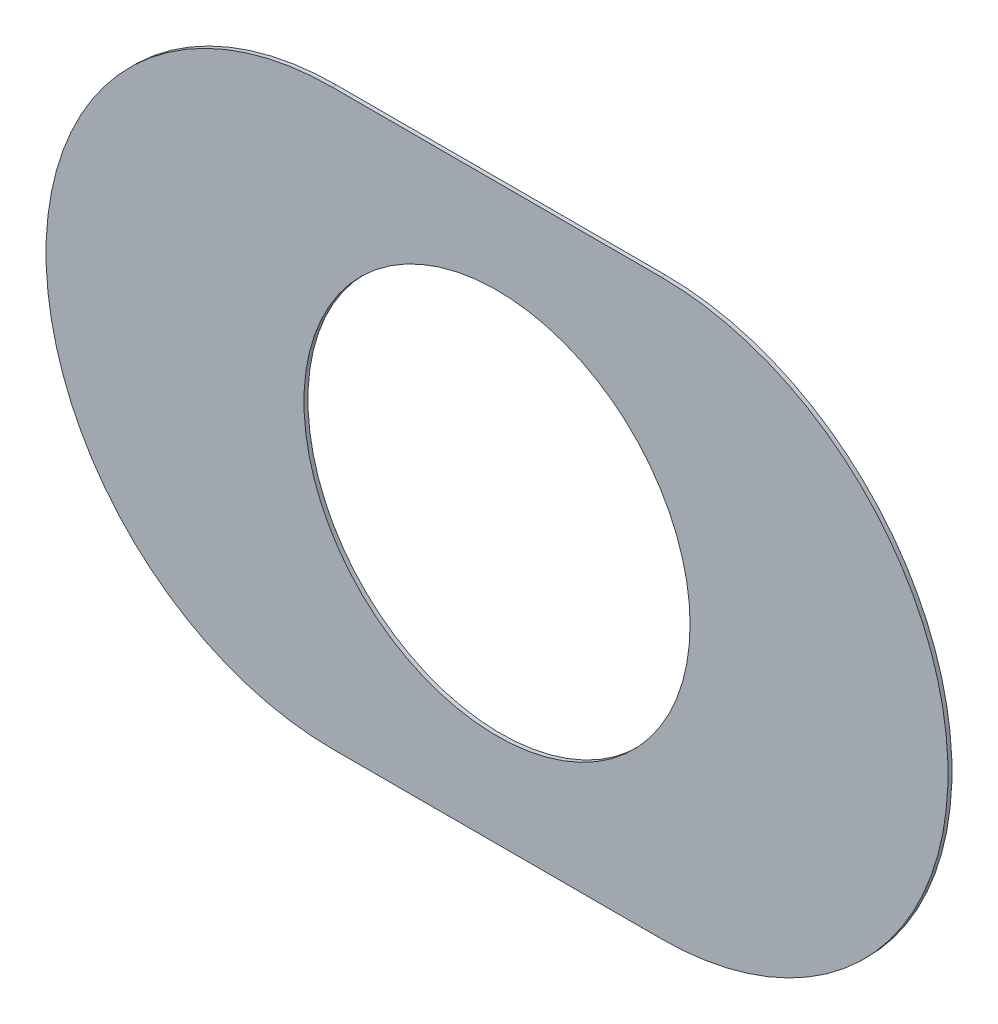
ISO-10303-21;
HEADER;
FILE_DESCRIPTION(('STEP AP214'),'2;1');
FILE_NAME('part.step','',(''),(''),'','','');
FILE_SCHEMA(('AUTOMOTIVE_DESIGN { 1 0 10303 214 1 1 1 1 }'));
ENDSEC;
DATA;
#1=APPLICATION_CONTEXT('core data for automotive mechanical design processes');
#2=APPLICATION_PROTOCOL_DEFINITION('international standard','automotive_design',2000,#1);
#3=PRODUCT_CONTEXT('',#1,'mechanical');
#4=PRODUCT('Part','Part','',(#3));
#5=PRODUCT_RELATED_PRODUCT_CATEGORY('part','',(#4));
#6=PRODUCT_DEFINITION_FORMATION('','',#4);
#7=PRODUCT_DEFINITION_CONTEXT('part definition',#1,'design');
#8=PRODUCT_DEFINITION('design','',#6,#7);
#9=PRODUCT_DEFINITION_SHAPE('','',#8);
#10=(LENGTH_UNIT() NAMED_UNIT(*) SI_UNIT(.MILLI.,.METRE.));
#11=(NAMED_UNIT(*) PLANE_ANGLE_UNIT() SI_UNIT($,.RADIAN.));
#12=(NAMED_UNIT(*) SI_UNIT($,.STERADIAN.) SOLID_ANGLE_UNIT());
#13=UNCERTAINTY_MEASURE_WITH_UNIT(LENGTH_MEASURE(1.E-05),#10,'distance_accuracy_value','');
#14=(GEOMETRIC_REPRESENTATION_CONTEXT(3) GLOBAL_UNCERTAINTY_ASSIGNED_CONTEXT((#13)) GLOBAL_UNIT_ASSIGNED_CONTEXT((#10,
#11,#12)) REPRESENTATION_CONTEXT('',''));
#15=CARTESIAN_POINT('',(0.,0.,0.));
#16=DIRECTION('',(0.,0.,1.));
#17=DIRECTION('',(1.,0.,0.));
#18=AXIS2_PLACEMENT_3D('',#15,#16,#17);
#19=CARTESIAN_POINT('',(24.3000003427268,27.2400006854535,0.));
#20=DIRECTION('',(0.,0.,1.));
#21=DIRECTION('',(1.,0.,0.));
#22=AXIS2_PLACEMENT_3D('',#19,#20,#21);
#23=PLANE('',#22);
#24=CARTESIAN_POINT('',(24.3000003427268,27.2400006854535,0.));
#25=DIRECTION('',(0.,0.,-1.));
#26=DIRECTION('',(-1.,0.,0.));
#27=AXIS2_PLACEMENT_3D('',#24,#25,#26);
#28=CIRCLE('',#27,0.49);
#29=CARTESIAN_POINT('',(24.7900003427268,27.2400006854535,0.));
#30=VERTEX_POINT('',#29);
#31=EDGE_CURVE('E100',#30,#30,#28,.T.);
#32=ORIENTED_EDGE('',*,*,#31,.T.);
#33=EDGE_LOOP('',(#32));
#34=FACE_BOUND('',#33,.T.);
#35=CARTESIAN_POINT('',(23.8825938881802,27.2400006854535,0.));
#36=DIRECTION('',(0.,0.,1.));
#37=DIRECTION('',(0.,1.,0.));
#38=AXIS2_PLACEMENT_3D('',#35,#36,#37);
#39=CIRCLE('',#38,0.727257121659981);
#40=CARTESIAN_POINT('',(23.8825938881802,27.9672578071135,0.));
#41=VERTEX_POINT('',#40);
#42=CARTESIAN_POINT('',(23.8825938881802,26.5127435637935,0.));
#43=VERTEX_POINT('',#42);
#44=EDGE_CURVE('E28',#41,#43,#39,.T.);
#45=ORIENTED_EDGE('',*,*,#44,.T.);
#46=DIRECTION('',(1.,0.,0.));
#47=VECTOR('',#46,1.);
#48=CARTESIAN_POINT('',(23.8825938881802,26.5127435637935,0.));
#49=LINE('',#48,#47);
#50=CARTESIAN_POINT('',(24.7174067972734,26.5127435637935,0.));
#51=VERTEX_POINT('',#50);
#52=EDGE_CURVE('E83',#43,#51,#49,.T.);
#53=ORIENTED_EDGE('',*,*,#52,.T.);
#54=CARTESIAN_POINT('',(24.7174067972734,27.2400006854535,0.));
#55=DIRECTION('',(0.,0.,1.));
#56=DIRECTION('',(0.,-1.,0.));
#57=AXIS2_PLACEMENT_3D('',#54,#55,#56);
#58=CIRCLE('',#57,0.727257121659981);
#59=CARTESIAN_POINT('',(24.7174067972734,27.9672578071135,0.));
#60=VERTEX_POINT('',#59);
#61=EDGE_CURVE('E140',#51,#60,#58,.T.);
#62=ORIENTED_EDGE('',*,*,#61,.T.);
#63=DIRECTION('',(-1.,0.,0.));
#64=VECTOR('',#63,1.);
#65=CARTESIAN_POINT('',(24.7174067972734,27.9672578071135,0.));
#66=LINE('',#65,#64);
#67=EDGE_CURVE('E94',#60,#41,#66,.T.);
#68=ORIENTED_EDGE('',*,*,#67,.T.);
#69=EDGE_LOOP('',(#45,#53,#62,#68));
#70=FACE_BOUND('',#69,.T.);
#71=ADVANCED_FACE('F17',(#34,#70),#23,.T.);
#72=CARTESIAN_POINT('',(24.3000003427268,27.2400006854535,-0.01));
#73=DIRECTION('',(0.,0.,1.));
#74=DIRECTION('',(1.,0.,0.));
#75=AXIS2_PLACEMENT_3D('',#72,#73,#74);
#76=PLANE('',#75);
#77=CARTESIAN_POINT('',(24.3000003427268,27.2400006854535,-0.01));
#78=DIRECTION('',(0.,0.,-1.));
#79=DIRECTION('',(-1.,0.,0.));
#80=AXIS2_PLACEMENT_3D('',#77,#78,#79);
#81=CIRCLE('',#80,0.49);
#82=CARTESIAN_POINT('',(24.7900003427268,27.2400006854535,-0.01));
#83=VERTEX_POINT('',#82);
#84=EDGE_CURVE('E120',#83,#83,#81,.T.);
#85=ORIENTED_EDGE('',*,*,#84,.F.);
#86=EDGE_LOOP('',(#85));
#87=FACE_BOUND('',#86,.T.);
#88=CARTESIAN_POINT('',(23.8825938881802,27.2400006854535,-0.01));
#89=DIRECTION('',(0.,0.,1.));
#90=DIRECTION('',(0.,1.,0.));
#91=AXIS2_PLACEMENT_3D('',#88,#89,#90);
#92=CIRCLE('',#91,0.727257121659981);
#93=CARTESIAN_POINT('',(23.8825938881802,27.9672578071135,-0.01));
#94=VERTEX_POINT('',#93);
#95=CARTESIAN_POINT('',(23.8825938881802,26.5127435637935,-0.01));
#96=VERTEX_POINT('',#95);
#97=EDGE_CURVE('E11',#94,#96,#92,.T.);
#98=ORIENTED_EDGE('',*,*,#97,.F.);
#99=DIRECTION('',(-1.,0.,0.));
#100=VECTOR('',#99,1.);
#101=CARTESIAN_POINT('',(24.7174067972734,27.9672578071135,-0.01));
#102=LINE('',#101,#100);
#103=CARTESIAN_POINT('',(24.7174067972734,27.9672578071135,-0.01));
#104=VERTEX_POINT('',#103);
#105=EDGE_CURVE('E86',#104,#94,#102,.T.);
#106=ORIENTED_EDGE('',*,*,#105,.F.);
#107=CARTESIAN_POINT('',(24.7174067972734,27.2400006854535,-0.01));
#108=DIRECTION('',(0.,0.,1.));
#109=DIRECTION('',(0.,-1.,0.));
#110=AXIS2_PLACEMENT_3D('',#107,#108,#109);
#111=CIRCLE('',#110,0.727257121659981);
#112=CARTESIAN_POINT('',(24.7174067972734,26.5127435637935,-0.01));
#113=VERTEX_POINT('',#112);
#114=EDGE_CURVE('E74',#113,#104,#111,.T.);
#115=ORIENTED_EDGE('',*,*,#114,.F.);
#116=DIRECTION('',(1.,0.,0.));
#117=VECTOR('',#116,1.);
#118=CARTESIAN_POINT('',(23.8825938881802,26.5127435637935,-0.01));
#119=LINE('',#118,#117);
#120=EDGE_CURVE('E103',#96,#113,#119,.T.);
#121=ORIENTED_EDGE('',*,*,#120,.F.);
#122=EDGE_LOOP('',(#98,#106,#115,#121));
#123=FACE_BOUND('',#122,.T.);
#124=ADVANCED_FACE('F87',(#87,#123),#76,.F.);
#125=CARTESIAN_POINT('',(23.8825938881802,27.2400006854535,0.));
#126=DIRECTION('',(0.,0.,1.));
#127=DIRECTION('',(0.,1.,0.));
#128=AXIS2_PLACEMENT_3D('',#125,#126,#127);
#129=CYLINDRICAL_SURFACE('',#128,0.727257121659981);
#130=ORIENTED_EDGE('',*,*,#44,.F.);
#131=DIRECTION('',(0.,0.,-1.));
#132=VECTOR('',#131,1.);
#133=CARTESIAN_POINT('',(23.8825938881802,27.9672578071135,0.));
#134=LINE('',#133,#132);
#135=EDGE_CURVE('E21',#41,#94,#134,.T.);
#136=ORIENTED_EDGE('',*,*,#135,.T.);
#137=ORIENTED_EDGE('',*,*,#97,.T.);
#138=DIRECTION('',(0.,0.,-1.));
#139=VECTOR('',#138,1.);
#140=CARTESIAN_POINT('',(23.8825938881802,26.5127435637935,0.));
#141=LINE('',#140,#139);
#142=EDGE_CURVE('E109',#43,#96,#141,.T.);
#143=ORIENTED_EDGE('',*,*,#142,.F.);
#144=EDGE_LOOP('',(#130,#136,#137,#143));
#145=FACE_BOUND('',#144,.T.);
#146=ADVANCED_FACE('F146',(#145),#129,.T.);
#147=CARTESIAN_POINT('',(23.8825938881802,26.5127435637935,0.));
#148=DIRECTION('',(0.,1.,0.));
#149=DIRECTION('',(1.,0.,0.));
#150=AXIS2_PLACEMENT_3D('',#147,#148,#149);
#151=PLANE('',#150);
#152=ORIENTED_EDGE('',*,*,#52,.F.);
#153=ORIENTED_EDGE('',*,*,#142,.T.);
#154=ORIENTED_EDGE('',*,*,#120,.T.);
#155=DIRECTION('',(0.,0.,-1.));
#156=VECTOR('',#155,1.);
#157=CARTESIAN_POINT('',(24.7174067972734,26.5127435637935,0.));
#158=LINE('',#157,#156);
#159=EDGE_CURVE('E81',#51,#113,#158,.T.);
#160=ORIENTED_EDGE('',*,*,#159,.F.);
#161=EDGE_LOOP('',(#152,#153,#154,#160));
#162=FACE_BOUND('',#161,.T.);
#163=ADVANCED_FACE('F158',(#162),#151,.F.);
#164=CARTESIAN_POINT('',(24.7174067972734,27.2400006854535,0.));
#165=DIRECTION('',(0.,0.,1.));
#166=DIRECTION('',(0.,-1.,0.));
#167=AXIS2_PLACEMENT_3D('',#164,#165,#166);
#168=CYLINDRICAL_SURFACE('',#167,0.727257121659981);
#169=ORIENTED_EDGE('',*,*,#61,.F.);
#170=ORIENTED_EDGE('',*,*,#159,.T.);
#171=ORIENTED_EDGE('',*,*,#114,.T.);
#172=DIRECTION('',(0.,0.,-1.));
#173=VECTOR('',#172,1.);
#174=CARTESIAN_POINT('',(24.7174067972734,27.9672578071135,0.));
#175=LINE('',#174,#173);
#176=EDGE_CURVE('E78',#60,#104,#175,.T.);
#177=ORIENTED_EDGE('',*,*,#176,.F.);
#178=EDGE_LOOP('',(#169,#170,#171,#177));
#179=FACE_BOUND('',#178,.T.);
#180=ADVANCED_FACE('F76',(#179),#168,.T.);
#181=CARTESIAN_POINT('',(24.7174067972734,27.9672578071135,0.));
#182=DIRECTION('',(0.,-1.,0.));
#183=DIRECTION('',(0.,0.,-1.));
#184=AXIS2_PLACEMENT_3D('',#181,#182,#183);
#185=PLANE('',#184);
#186=ORIENTED_EDGE('',*,*,#67,.F.);
#187=ORIENTED_EDGE('',*,*,#176,.T.);
#188=ORIENTED_EDGE('',*,*,#105,.T.);
#189=ORIENTED_EDGE('',*,*,#135,.F.);
#190=EDGE_LOOP('',(#186,#187,#188,#189));
#191=FACE_BOUND('',#190,.T.);
#192=ADVANCED_FACE('F92',(#191),#185,.F.);
#193=CARTESIAN_POINT('',(24.3000003427268,27.2400006854535,0.));
#194=DIRECTION('',(0.,0.,1.));
#195=DIRECTION('',(-1.,0.,0.));
#196=AXIS2_PLACEMENT_3D('',#193,#194,#195);
#197=CYLINDRICAL_SURFACE('',#196,0.49);
#198=ORIENTED_EDGE('',*,*,#84,.T.);
#199=DIRECTION('',(0.,0.,1.));
#200=VECTOR('',#199,1.);
#201=CARTESIAN_POINT('',(24.7900003427268,27.2400006854535,0.));
#202=LINE('',#201,#200);
#203=EDGE_CURVE('E118',#83,#30,#202,.T.);
#204=ORIENTED_EDGE('',*,*,#203,.T.);
#205=ORIENTED_EDGE('',*,*,#31,.F.);
#206=ORIENTED_EDGE('',*,*,#203,.F.);
#207=EDGE_LOOP('',(#198,#204,#205,#206));
#208=FACE_BOUND('',#207,.T.);
#209=ADVANCED_FACE('F19',(#208),#197,.F.);
#210=CLOSED_SHELL('',(#71,#124,#146,#163,#180,#192,#209));
#211=MANIFOLD_SOLID_BREP('B1',#210);
#212=ADVANCED_BREP_SHAPE_REPRESENTATION('',(#18,#211),#14);
#213=SHAPE_DEFINITION_REPRESENTATION(#9,#212);
ENDSEC;
END-ISO-10303-21;
